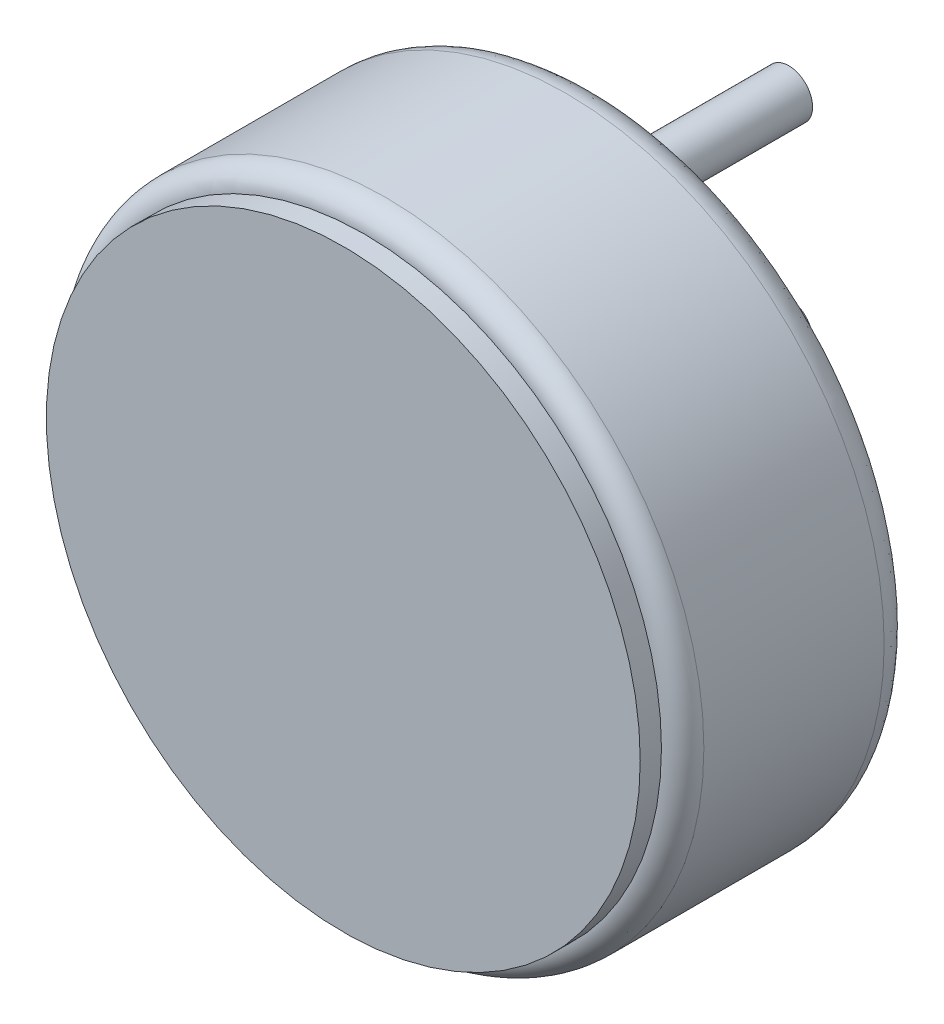
ISO-10303-21;
HEADER;
FILE_DESCRIPTION(('STEP AP214'),'2;1');
FILE_NAME('part.step','',(''),(''),'','','');
FILE_SCHEMA(('AUTOMOTIVE_DESIGN { 1 0 10303 214 1 1 1 1 }'));
ENDSEC;
DATA;
#1=APPLICATION_CONTEXT('core data for automotive mechanical design processes');
#2=APPLICATION_PROTOCOL_DEFINITION('international standard','automotive_design',2000,#1);
#3=PRODUCT_CONTEXT('',#1,'mechanical');
#4=PRODUCT('Part','Part','',(#3));
#5=PRODUCT_RELATED_PRODUCT_CATEGORY('part','',(#4));
#6=PRODUCT_DEFINITION_FORMATION('','',#4);
#7=PRODUCT_DEFINITION_CONTEXT('part definition',#1,'design');
#8=PRODUCT_DEFINITION('design','',#6,#7);
#9=PRODUCT_DEFINITION_SHAPE('','',#8);
#10=(LENGTH_UNIT() NAMED_UNIT(*) SI_UNIT(.MILLI.,.METRE.));
#11=(NAMED_UNIT(*) PLANE_ANGLE_UNIT() SI_UNIT($,.RADIAN.));
#12=(NAMED_UNIT(*) SI_UNIT($,.STERADIAN.) SOLID_ANGLE_UNIT());
#13=UNCERTAINTY_MEASURE_WITH_UNIT(LENGTH_MEASURE(1.E-05),#10,'distance_accuracy_value','');
#14=(GEOMETRIC_REPRESENTATION_CONTEXT(3) GLOBAL_UNCERTAINTY_ASSIGNED_CONTEXT((#13)) GLOBAL_UNIT_ASSIGNED_CONTEXT((#10,
#11,#12)) REPRESENTATION_CONTEXT('',''));
#15=CARTESIAN_POINT('',(0.,0.,0.));
#16=DIRECTION('',(0.,0.,1.));
#17=DIRECTION('',(1.,0.,0.));
#18=AXIS2_PLACEMENT_3D('',#15,#16,#17);
#19=CARTESIAN_POINT('',(0.,2.39999999999999,-0.8));
#20=CARTESIAN_POINT('',(-4.79999999999998,2.39999999999999,-0.8));
#21=CARTESIAN_POINT('',(-4.79999999999998,-2.39999999999999,-0.8));
#22=CARTESIAN_POINT('',(0.,-2.39999999999999,-0.8));
#23=CARTESIAN_POINT('',(4.79999999999998,-2.39999999999999,-0.8));
#24=CARTESIAN_POINT('',(4.79999999999998,2.39999999999999,-0.8));
#25=CARTESIAN_POINT('',(0.,2.39999999999999,-0.8));
#26=CARTESIAN_POINT('',(0.,2.39999999999999,-0.976682190684143));
#27=CARTESIAN_POINT('',(-4.79999999999998,2.39999999999999,-0.976682190684143));
#28=CARTESIAN_POINT('',(-4.79999999999998,-2.39999999999999,-0.976682190684143));
#29=CARTESIAN_POINT('',(0.,-2.39999999999999,-0.976682190684143));
#30=CARTESIAN_POINT('',(4.79999999999998,-2.39999999999999,-0.976682190684143));
#31=CARTESIAN_POINT('',(4.79999999999998,2.39999999999999,-0.976682190684143));
#32=CARTESIAN_POINT('',(0.,2.39999999999999,-0.976682190684143));
#33=CARTESIAN_POINT('',(0.,2.52521244331984,-1.10000000000001));
#34=CARTESIAN_POINT('',(-5.05042488663967,2.52521244331984,-1.10000000000001));
#35=CARTESIAN_POINT('',(-5.05042488663967,-2.52521244331984,-1.10000000000001));
#36=CARTESIAN_POINT('',(0.,-2.52521244331984,-1.10000000000001));
#37=CARTESIAN_POINT('',(5.05042488663967,-2.52521244331984,-1.10000000000001));
#38=CARTESIAN_POINT('',(5.05042488663967,2.52521244331984,-1.10000000000001));
#39=CARTESIAN_POINT('',(0.,2.52521244331984,-1.10000000000001));
#40=CARTESIAN_POINT('',(0.,2.7,-1.10000000000001));
#41=CARTESIAN_POINT('',(-5.40000000000001,2.7,-1.10000000000001));
#42=CARTESIAN_POINT('',(-5.40000000000001,-2.7,-1.10000000000001));
#43=CARTESIAN_POINT('',(0.,-2.7,-1.10000000000001));
#44=CARTESIAN_POINT('',(5.40000000000001,-2.7,-1.10000000000001));
#45=CARTESIAN_POINT('',(5.40000000000001,2.7,-1.10000000000001));
#46=CARTESIAN_POINT('',(0.,2.7,-1.10000000000001));
#47=CARTESIAN_POINT('',(0.,2.87478755668017,-1.10000000000001));
#48=CARTESIAN_POINT('',(-5.74957511336034,2.87478755668017,-1.10000000000001));
#49=CARTESIAN_POINT('',(-5.74957511336034,-2.87478755668017,-1.10000000000001));
#50=CARTESIAN_POINT('',(0.,-2.87478755668017,-1.10000000000001));
#51=CARTESIAN_POINT('',(5.74957511336034,-2.87478755668017,-1.10000000000001));
#52=CARTESIAN_POINT('',(5.74957511336034,2.87478755668017,-1.10000000000001));
#53=CARTESIAN_POINT('',(0.,2.87478755668017,-1.10000000000001));
#54=CARTESIAN_POINT('',(0.,3.00000000000001,-0.97668219068414));
#55=CARTESIAN_POINT('',(-6.00000000000002,3.00000000000001,-0.97668219068414));
#56=CARTESIAN_POINT('',(-6.00000000000002,-3.00000000000001,-0.97668219068414));
#57=CARTESIAN_POINT('',(0.,-3.00000000000001,-0.97668219068414));
#58=CARTESIAN_POINT('',(6.00000000000002,-3.00000000000001,-0.97668219068414));
#59=CARTESIAN_POINT('',(6.00000000000002,3.00000000000001,-0.97668219068414));
#60=CARTESIAN_POINT('',(0.,3.00000000000001,-0.97668219068414));
#61=CARTESIAN_POINT('',(0.,3.00000000000001,-0.8));
#62=CARTESIAN_POINT('',(-6.00000000000002,3.00000000000001,-0.8));
#63=CARTESIAN_POINT('',(-6.00000000000002,-3.00000000000001,-0.8));
#64=CARTESIAN_POINT('',(0.,-3.00000000000001,-0.8));
#65=CARTESIAN_POINT('',(6.00000000000002,-3.00000000000001,-0.8));
#66=CARTESIAN_POINT('',(6.00000000000002,3.00000000000001,-0.8));
#67=CARTESIAN_POINT('',(0.,3.00000000000001,-0.8));
#68=(BOUNDED_SURFACE() B_SPLINE_SURFACE(3,3,((#19,#20,#21,#22,#23,#24,#25),(#26,#27,#28,#29,#30,
#31,#32),(#33,#34,#35,#36,#37,#38,#39),(#40,#41,#42,#43,#44,#45,#46),(#47,#48,#49,#50,#51,#52,
#53),(#54,#55,#56,#57,#58,#59,#60),(#61,#62,#63,#64,#65,#66,#67)),.UNSPECIFIED.,.F.,.T.,
.F.) B_SPLINE_SURFACE_WITH_KNOTS((4,3,4),(4,3,4),(0.0212660887288256,0.5,0.978733911271166),(0.,
0.5,1.),
.UNSPECIFIED.) GEOMETRIC_REPRESENTATION_ITEM() RATIONAL_B_SPLINE_SURFACE(((0.974307502872988,
0.324769167624329,0.324769167624329,0.974307502872988,0.324769167624329,0.324769167624329,
0.974307502872988),(0.790078503890234,0.263359501296745,0.263359501296745,0.790078503890234,
0.263359501296745,0.263359501296745,0.790078503890234),(0.798642669599238,0.266214223199746,
0.266214223199746,0.798642669599238,0.266214223199746,0.266214223199746,0.798642669599238),(1.,
0.333333333333333,0.333333333333333,1.,0.333333333333333,0.333333333333333,1.),
(0.798642669599241,0.266214223199747,0.266214223199747,0.798642669599241,0.266214223199747,
0.266214223199747,0.798642669599241),(0.790078503890234,0.263359501296745,0.263359501296745,
0.790078503890234,0.263359501296745,0.263359501296745,0.790078503890234),(0.974307502872978,
0.324769167624326,0.324769167624326,0.974307502872978,0.324769167624326,0.324769167624326,0.974307502872978))) REPRESENTATION_ITEM('') SURFACE());
#69=CARTESIAN_POINT('',(0.,0.,-0.8));
#70=DIRECTION('',(0.,0.,-1.));
#71=DIRECTION('',(1.,0.,0.));
#72=AXIS2_PLACEMENT_3D('',#69,#70,#71);
#73=CIRCLE('',#72,2.39999999999999);
#74=CARTESIAN_POINT('',(0.,2.39999999999999,-0.8));
#75=VERTEX_POINT('',#74);
#76=EDGE_CURVE('E10',#75,#75,#73,.T.);
#77=CARTESIAN_POINT('',(0.,0.,-0.8));
#78=DIRECTION('',(0.,0.,1.));
#79=DIRECTION('',(0.,1.,0.));
#80=AXIS2_PLACEMENT_3D('',#77,#78,#79);
#81=CIRCLE('',#80,3.00000000000001);
#82=CARTESIAN_POINT('',(0.,3.00000000000001,-0.8));
#83=VERTEX_POINT('',#82);
#84=EDGE_CURVE('E26',#83,#83,#81,.T.);
#85=CARTESIAN_POINT('',(0.,2.39999999999999,-0.8));
#86=CARTESIAN_POINT('',(0.,2.39999999537428,-0.802248524345517));
#87=CARTESIAN_POINT('',(0.,2.40002527912279,-0.804497048930105));
#88=CARTESIAN_POINT('',(0.,2.40012682948026,-0.809012486777327));
#89=CARTESIAN_POINT('',(0.,2.40020353699144,-0.811279390131672));
#90=CARTESIAN_POINT('',(0.,2.40040921034804,-0.815830049550972));
#91=CARTESIAN_POINT('',(0.,2.40053861295298,-0.818113785883139));
#92=CARTESIAN_POINT('',(0.,2.40085089468133,-0.822696492031536));
#93=CARTESIAN_POINT('',(0.,2.40103420535382,-0.8249954324472));
#94=CARTESIAN_POINT('',(0.,2.40145546704193,-0.829606845405866));
#95=CARTESIAN_POINT('',(0.,2.40169384338838,-0.831919279100699));
#96=CARTESIAN_POINT('',(0.,2.40222633763611,-0.836555896950443));
#97=CARTESIAN_POINT('',(0.,2.40252087361232,-0.838880033097727));
#98=CARTESIAN_POINT('',(0.,2.40316672048629,-0.84353819608264));
#99=CARTESIAN_POINT('',(0.,2.40351844116687,-0.845872166110669));
#100=CARTESIAN_POINT('',(0.,2.40427961695318,-0.850548061678776));
#101=CARTESIAN_POINT('',(0.,2.40468947251464,-0.852889922035671));
#102=CARTESIAN_POINT('',(0.,2.40556779798212,-0.85757959083924));
#103=CARTESIAN_POINT('',(0.,2.40603665799158,-0.859927326229259));
#104=CARTESIAN_POINT('',(0.,2.4070337870254,-0.864626669078881));
#105=CARTESIAN_POINT('',(0.,2.40756243479207,-0.866978196180446));
#106=CARTESIAN_POINT('',(0.,2.40867984327279,-0.871682981961354));
#107=CARTESIAN_POINT('',(0.,2.40926897038304,-0.874036153624924));
#108=CARTESIAN_POINT('',(0.,2.41050794545649,-0.878742028169759));
#109=CARTESIAN_POINT('',(0.,2.41115814651607,-0.881094638091604));
#110=CARTESIAN_POINT('',(0.,2.41251977632833,-0.88579713399666));
#111=CARTESIAN_POINT('',(0.,2.41323154396272,-0.888146921859499));
#112=CARTESIAN_POINT('',(0.,2.41471670795497,-0.89284146922192));
#113=CARTESIAN_POINT('',(0.,2.41549042811144,-0.895186126288885));
#114=CARTESIAN_POINT('',(0.,2.41709978796353,-0.899868064332924));
#115=CARTESIAN_POINT('',(0.,2.41793573556019,-0.902205239476503));
#116=CARTESIAN_POINT('',(0.,2.41966972687206,-0.906869829027327));
#117=CARTESIAN_POINT('',(0.,2.42056806183751,-0.909197135170108));
#118=CARTESIAN_POINT('',(0.,2.42242688663436,-0.913839571923995));
#119=CARTESIAN_POINT('',(0.,2.42338765038032,-0.916154592863241));
#120=CARTESIAN_POINT('',(0.,2.42537127052421,-0.920770021393448));
#121=CARTESIAN_POINT('',(0.,2.42639438289113,-0.923070318976784));
#122=CARTESIAN_POINT('',(0.,2.42850251447644,-0.927653847405092));
#123=CARTESIAN_POINT('',(0.,2.42958777118961,-0.929936969020049));
#124=CARTESIAN_POINT('',(0.,2.43181987999413,-0.934483684275078));
#125=CARTESIAN_POINT('',(0.,2.43296695066433,-0.936747170610896));
#126=CARTESIAN_POINT('',(0.,2.43532224872052,-0.941252154185934));
#127=CARTESIAN_POINT('',(0.,2.43653067541965,-0.943493547222024));
#128=CARTESIAN_POINT('',(0.,2.4390081187625,-0.947951891337491));
#129=CARTESIAN_POINT('',(0.,2.44027731520013,-0.95016874250934));
#130=CARTESIAN_POINT('',(0.,2.44287560283889,-0.954575566578184));
#131=CARTESIAN_POINT('',(0.,2.44420485416096,-0.956765445068303));
#132=CARTESIAN_POINT('',(0.,2.44692242831212,-0.961115912356821));
#133=CARTESIAN_POINT('',(0.,2.44831089153789,-0.963276413455719));
#134=CARTESIAN_POINT('',(0.,2.45114593914593,-0.967565747827592));
#135=CARTESIAN_POINT('',(0.,2.45259264425349,-0.969694501307674));
#136=CARTESIAN_POINT('',(0.,2.45554309981455,-0.973918003935484));
#137=CARTESIAN_POINT('',(0.,2.45704695147971,-0.976012682379358));
#138=CARTESIAN_POINT('',(0.,2.46011050117144,-0.980165748305686));
#139=CARTESIAN_POINT('',(0.,2.46167028115851,-0.982224075329593));
#140=CARTESIAN_POINT('',(0.,2.46484436826723,-0.986302209758947));
#141=CARTESIAN_POINT('',(0.,2.4664587384642,-0.98832196807198));
#142=CARTESIAN_POINT('',(0.,2.4697405700882,-0.992320802275409));
#143=CARTESIAN_POINT('',(0.,2.47140807617255,-0.994299841515817));
#144=CARTESIAN_POINT('',(0.,2.47479463116794,-0.998215148232091));
#145=CARTESIAN_POINT('',(0.,2.47651370688351,-1.00015139252336));
#146=CARTESIAN_POINT('',(0.,2.4800017450072,-1.00397910074405));
#147=CARTESIAN_POINT('',(0.,2.48177071702612,-1.00587055591554));
#148=CARTESIAN_POINT('',(0.,2.4853567892188,-1.00960676494615));
#149=CARTESIAN_POINT('',(0.,2.48717388255742,-1.01145152536576));
#150=CARTESIAN_POINT('',(0.,2.49085434229836,-1.01509251806138));
#151=CARTESIAN_POINT('',(0.,2.49271768625022,-1.01688877303127));
#152=CARTESIAN_POINT('',(0.,2.49648870190555,-1.02043102811245));
#153=CARTESIAN_POINT('',(0.,2.49839633644992,-1.02217706778273));
#154=CARTESIAN_POINT('',(0.,2.50225390452663,-1.02561727114608));
#155=CARTESIAN_POINT('',(0.,2.50420378716664,-1.027311491906));
#156=CARTESIAN_POINT('',(0.,2.50814374637647,-1.0306465468535));
#157=CARTESIAN_POINT('',(0.,2.5101337593568,-1.03228745616475));
#158=CARTESIAN_POINT('',(0.,2.51415180538683,-1.03551449248629));
#159=CARTESIAN_POINT('',(0.,2.51617976323812,-1.03710071312834));
#160=CARTESIAN_POINT('',(0.,2.52027146411943,-1.04021709498321));
#161=CARTESIAN_POINT('',(0.,2.52233512147365,-1.04174736868645));
#162=CARTESIAN_POINT('',(0.,2.5264959334347,-1.04475070124111));
#163=CARTESIAN_POINT('',(0.,2.528592993054,-1.04622389168956));
#164=CARTESIAN_POINT('',(0.,2.53281827674251,-1.04911202648132));
#165=CARTESIAN_POINT('',(0.,2.53494639770299,-1.05052712167259));
#166=CARTESIAN_POINT('',(0.,2.5392314346586,-1.0532981606808));
#167=CARTESIAN_POINT('',(0.,2.54138824062978,-1.05465427463738));
#168=CARTESIAN_POINT('',(0.,2.54572824988936,-1.05730657305616));
#169=CARTESIAN_POINT('',(0.,2.54791133745074,-1.05860294688791));
#170=CARTESIAN_POINT('',(0.,2.55230149216963,-1.06113511460648));
#171=CARTESIAN_POINT('',(0.,2.55450843910637,-1.06237111693032));
#172=CARTESIAN_POINT('',(0.,2.55894388308146,-1.06478201873848));
#173=CARTESIAN_POINT('',(0.,2.56117225660289,-1.06595714546703));
#174=CARTESIAN_POINT('',(0.,2.56564812058703,-1.06824590001462));
#175=CARTESIAN_POINT('',(0.,2.56789548541418,-1.06935977353074));
#176=CARTESIAN_POINT('',(0.,2.57240690311669,-1.07152575108042));
#177=CARTESIAN_POINT('',(0.,2.57467082938735,-1.07257811881983));
#178=CARTESIAN_POINT('',(0.,2.57921295306136,-1.07462093784194));
#179=CARTESIAN_POINT('',(0.,2.58149102400486,-1.07561167031065));
#180=CARTESIAN_POINT('',(0.,2.58605903952902,-1.07753119297801));
#181=CARTESIAN_POINT('',(0.,2.58834885886645,-1.0784602812354));
#182=CARTESIAN_POINT('',(0.,2.59293800023669,-1.08025660788339));
#183=CARTESIAN_POINT('',(0.,2.59523719926629,-1.08112416052542));
#184=CARTESIAN_POINT('',(0.,2.59984276242135,-1.08279762314943));
#185=CARTESIAN_POINT('',(0.,2.6021490067532,-1.08360386282958));
#186=CARTESIAN_POINT('',(0.,2.6067663626668,-1.0851550176976));
#187=CARTESIAN_POINT('',(0.,2.60907735857567,-1.08590027722558));
#188=CARTESIAN_POINT('',(0.,2.6137019655574,-1.0873298966881));
#189=CARTESIAN_POINT('',(0.,2.61601546592683,-1.08801461474825));
#190=CARTESIAN_POINT('',(0.,2.62064288108322,-1.08932367833095));
#191=CARTESIAN_POINT('',(0.,2.62295669091928,-1.08994839486388));
#192=CARTESIAN_POINT('',(0.,2.62758258073606,-1.09113807973073));
#193=CARTESIAN_POINT('',(0.,2.62989456223349,-1.09170343102226));
#194=CARTESIAN_POINT('',(0.,2.63451471224953,-1.09277510189794));
#195=CARTESIAN_POINT('',(0.,2.63682278939784,-1.09328181541997));
#196=CARTESIAN_POINT('',(0.,2.64143311295041,-1.09423701406039));
#197=CARTESIAN_POINT('',(0.,2.64373527567201,-1.09468590310789));
#198=CARTESIAN_POINT('',(0.,2.64833182170198,-1.09552633740689));
#199=CARTESIAN_POINT('',(0.,2.65062612951896,-1.09591829557471));
#200=CARTESIAN_POINT('',(0.,2.65520508943277,-1.09664582839315));
#201=CARTESIAN_POINT('',(0.,2.65748967466246,-1.09698182393517));
#202=CARTESIAN_POINT('',(0.,2.66204738825685,-1.09759846173599));
#203=CARTESIAN_POINT('',(0.,2.66432045874185,-1.09787953184761));
#204=CARTESIAN_POINT('',(0.,2.66885341920073,-1.09838741321732));
#205=CARTESIAN_POINT('',(0.,2.67111326057729,-1.09861465828062));
#206=CARTESIAN_POINT('',(0.,2.67561811857107,-1.09901604241335));
#207=CARTESIAN_POINT('',(0.,2.67786309610187,-1.09919062024187));
#208=CARTESIAN_POINT('',(0.,2.68233666297445,-1.09948787545857));
#209=CARTESIAN_POINT('',(0.,2.6845652229056,-1.09961099557709));
#210=CARTESIAN_POINT('',(0.,2.68900447312779,-1.09980658794501));
#211=CARTESIAN_POINT('',(0.,2.69121514378657,-1.09987950593419));
#212=CARTESIAN_POINT('',(0.,2.69561721616707,-1.09997598805538));
#213=CARTESIAN_POINT('',(0.,2.69780860808354,-1.10000000000001));
#214=CARTESIAN_POINT('',(0.,2.70219139191646,-1.10000000000001));
#215=CARTESIAN_POINT('',(0.,2.70438278383293,-1.09997598805538));
#216=CARTESIAN_POINT('',(0.,2.70878485621343,-1.0998795059342));
#217=CARTESIAN_POINT('',(0.,2.71099552687221,-1.09980658794501));
#218=CARTESIAN_POINT('',(0.,2.7154347770944,-1.09961099557708));
#219=CARTESIAN_POINT('',(0.,2.71766333702555,-1.09948787545857));
#220=CARTESIAN_POINT('',(0.,2.72213690389813,-1.09919062024187));
#221=CARTESIAN_POINT('',(0.,2.72438188142893,-1.09901604241335));
#222=CARTESIAN_POINT('',(0.,2.72888673942271,-1.09861465828062));
#223=CARTESIAN_POINT('',(0.,2.73114658079927,-1.09838741321732));
#224=CARTESIAN_POINT('',(0.,2.73567954125815,-1.09787953184761));
#225=CARTESIAN_POINT('',(0.,2.73795261174315,-1.097598461736));
#226=CARTESIAN_POINT('',(0.,2.74251032533754,-1.09698182393517));
#227=CARTESIAN_POINT('',(0.,2.74479491056723,-1.09664582839315));
#228=CARTESIAN_POINT('',(0.,2.74937387048105,-1.09591829557471));
#229=CARTESIAN_POINT('',(0.,2.75166817829802,-1.09552633740689));
#230=CARTESIAN_POINT('',(0.,2.75626472432799,-1.09468590310789));
#231=CARTESIAN_POINT('',(0.,2.75856688704959,-1.09423701406039));
#232=CARTESIAN_POINT('',(0.,2.76317721060216,-1.09328181541997));
#233=CARTESIAN_POINT('',(0.,2.76548528775047,-1.09277510189794));
#234=CARTESIAN_POINT('',(0.,2.77010543776651,-1.09170343102226));
#235=CARTESIAN_POINT('',(0.,2.77241741926394,-1.09113807973073));
#236=CARTESIAN_POINT('',(0.,2.77704330908072,-1.08994839486388));
#237=CARTESIAN_POINT('',(0.,2.77935711891678,-1.08932367833095));
#238=CARTESIAN_POINT('',(0.,2.78398453407317,-1.08801461474825));
#239=CARTESIAN_POINT('',(0.,2.7862980344426,-1.0873298966881));
#240=CARTESIAN_POINT('',(0.,2.79092264142433,-1.08590027722558));
#241=CARTESIAN_POINT('',(0.,2.7932336373332,-1.0851550176976));
#242=CARTESIAN_POINT('',(0.,2.7978509932468,-1.08360386282959));
#243=CARTESIAN_POINT('',(0.,2.80015723757866,-1.08279762314943));
#244=CARTESIAN_POINT('',(0.,2.80476280073371,-1.08112416052542));
#245=CARTESIAN_POINT('',(0.,2.80706199976331,-1.08025660788339));
#246=CARTESIAN_POINT('',(0.,2.81165114113355,-1.0784602812354));
#247=CARTESIAN_POINT('',(0.,2.81394096047098,-1.07753119297801));
#248=CARTESIAN_POINT('',(0.,2.81850897599514,-1.07561167031065));
#249=CARTESIAN_POINT('',(0.,2.82078704693864,-1.07462093784194));
#250=CARTESIAN_POINT('',(0.,2.82532917061265,-1.07257811881983));
#251=CARTESIAN_POINT('',(0.,2.82759309688331,-1.07152575108042));
#252=CARTESIAN_POINT('',(0.,2.83210451458582,-1.06935977353074));
#253=CARTESIAN_POINT('',(0.,2.83435187941297,-1.06824590001462));
#254=CARTESIAN_POINT('',(0.,2.83882774339711,-1.06595714546703));
#255=CARTESIAN_POINT('',(0.,2.84105611691854,-1.06478201873848));
#256=CARTESIAN_POINT('',(0.,2.84549156089363,-1.06237111693032));
#257=CARTESIAN_POINT('',(0.,2.84769850783037,-1.06113511460648));
#258=CARTESIAN_POINT('',(0.,2.85208866254926,-1.05860294688791));
#259=CARTESIAN_POINT('',(0.,2.85427175011064,-1.05730657305616));
#260=CARTESIAN_POINT('',(0.,2.85861175937022,-1.05465427463739));
#261=CARTESIAN_POINT('',(0.,2.8607685653414,-1.0532981606808));
#262=CARTESIAN_POINT('',(0.,2.86505360229701,-1.0505271216726));
#263=CARTESIAN_POINT('',(0.,2.86718172325748,-1.04911202648132));
#264=CARTESIAN_POINT('',(0.,2.871407006946,-1.04622389168956));
#265=CARTESIAN_POINT('',(0.,2.8735040665653,-1.04475070124112));
#266=CARTESIAN_POINT('',(0.,2.87766487852635,-1.04174736868645));
#267=CARTESIAN_POINT('',(0.,2.87972853588057,-1.04021709498321));
#268=CARTESIAN_POINT('',(0.,2.88382023676188,-1.03710071312834));
#269=CARTESIAN_POINT('',(0.,2.88584819461317,-1.0355144924863));
#270=CARTESIAN_POINT('',(0.,2.8898662406432,-1.03228745616475));
#271=CARTESIAN_POINT('',(0.,2.89185625362353,-1.0306465468535));
#272=CARTESIAN_POINT('',(0.,2.89579621283336,-1.027311491906));
#273=CARTESIAN_POINT('',(0.,2.89774609547336,-1.02561727114608));
#274=CARTESIAN_POINT('',(0.,2.90160366355008,-1.02217706778273));
#275=CARTESIAN_POINT('',(0.,2.90351129809445,-1.02043102811246));
#276=CARTESIAN_POINT('',(0.,2.90728231374978,-1.01688877303127));
#277=CARTESIAN_POINT('',(0.,2.90914565770164,-1.01509251806138));
#278=CARTESIAN_POINT('',(0.,2.91282611744258,-1.01145152536576));
#279=CARTESIAN_POINT('',(0.,2.9146432107812,-1.00960676494615));
#280=CARTESIAN_POINT('',(0.,2.91822928297388,-1.00587055591554));
#281=CARTESIAN_POINT('',(0.,2.9199982549928,-1.00397910074405));
#282=CARTESIAN_POINT('',(0.,2.92348629311649,-1.00015139252337));
#283=CARTESIAN_POINT('',(0.,2.92520536883206,-0.998215148232092));
#284=CARTESIAN_POINT('',(0.,2.92859192382745,-0.994299841515818));
#285=CARTESIAN_POINT('',(0.,2.9302594299118,-0.99232080227541));
#286=CARTESIAN_POINT('',(0.,2.9335412615358,-0.988321968071981));
#287=CARTESIAN_POINT('',(0.,2.93515563173277,-0.986302209758948));
#288=CARTESIAN_POINT('',(0.,2.93832971884149,-0.982224075329595));
#289=CARTESIAN_POINT('',(0.,2.93988949882856,-0.980165748305687));
#290=CARTESIAN_POINT('',(0.,2.94295304852029,-0.976012682379359));
#291=CARTESIAN_POINT('',(0.,2.94445690018545,-0.973918003935486));
#292=CARTESIAN_POINT('',(0.,2.94740735574651,-0.969694501307676));
#293=CARTESIAN_POINT('',(0.,2.94885406085407,-0.967565747827593));
#294=CARTESIAN_POINT('',(0.,2.95168910846211,-0.96327641345572));
#295=CARTESIAN_POINT('',(0.,2.95307757168788,-0.961115912356822));
#296=CARTESIAN_POINT('',(0.,2.95579514583904,-0.956765445068304));
#297=CARTESIAN_POINT('',(0.,2.95712439716111,-0.954575566578185));
#298=CARTESIAN_POINT('',(0.,2.95972268479987,-0.950168742509341));
#299=CARTESIAN_POINT('',(0.,2.9609918812375,-0.947951891337493));
#300=CARTESIAN_POINT('',(0.,2.96346932458035,-0.943493547222025));
#301=CARTESIAN_POINT('',(0.,2.96467775127948,-0.941252154185935));
#302=CARTESIAN_POINT('',(0.,2.96703304933567,-0.936747170610897));
#303=CARTESIAN_POINT('',(0.,2.96818012000587,-0.934483684275079));
#304=CARTESIAN_POINT('',(0.,2.97041222881039,-0.92993696902005));
#305=CARTESIAN_POINT('',(0.,2.97149748552356,-0.927653847405093));
#306=CARTESIAN_POINT('',(0.,2.97360561710887,-0.923070318976785));
#307=CARTESIAN_POINT('',(0.,2.97462872947579,-0.920770021393449));
#308=CARTESIAN_POINT('',(0.,2.97661234961968,-0.916154592863242));
#309=CARTESIAN_POINT('',(0.,2.97757311336564,-0.913839571923996));
#310=CARTESIAN_POINT('',(0.,2.97943193816249,-0.90919713517011));
#311=CARTESIAN_POINT('',(0.,2.98033027312794,-0.906869829027328));
#312=CARTESIAN_POINT('',(0.,2.98206426443981,-0.902205239476504));
#313=CARTESIAN_POINT('',(0.,2.98290021203646,-0.899868064332925));
#314=CARTESIAN_POINT('',(0.,2.98450957188856,-0.895186126288887));
#315=CARTESIAN_POINT('',(0.,2.98528329204503,-0.892841469221922));
#316=CARTESIAN_POINT('',(0.,2.98676845603728,-0.8881469218595));
#317=CARTESIAN_POINT('',(0.,2.98748022367167,-0.885797133996661));
#318=CARTESIAN_POINT('',(0.,2.98884185348393,-0.881094638091605));
#319=CARTESIAN_POINT('',(0.,2.98949205454351,-0.87874202816976));
#320=CARTESIAN_POINT('',(0.,2.99073102961696,-0.874036153624925));
#321=CARTESIAN_POINT('',(0.,2.99132015672721,-0.871682981961356));
#322=CARTESIAN_POINT('',(0.,2.99243756520793,-0.866978196180447));
#323=CARTESIAN_POINT('',(0.,2.9929662129746,-0.864626669078882));
#324=CARTESIAN_POINT('',(0.,2.99396334200842,-0.85992732622926));
#325=CARTESIAN_POINT('',(0.,2.99443220201788,-0.857579590839241));
#326=CARTESIAN_POINT('',(0.,2.99531052748536,-0.852889922035672));
#327=CARTESIAN_POINT('',(0.,2.99572038304682,-0.850548061678777));
#328=CARTESIAN_POINT('',(0.,2.99648155883313,-0.84587216611067));
#329=CARTESIAN_POINT('',(0.,2.99683327951371,-0.843538196082641));
#330=CARTESIAN_POINT('',(0.,2.99747912638768,-0.838880033097728));
#331=CARTESIAN_POINT('',(0.,2.99777366236389,-0.836555896950444));
#332=CARTESIAN_POINT('',(0.,2.99830615661162,-0.831919279100699));
#333=CARTESIAN_POINT('',(0.,2.99854453295807,-0.829606845405867));
#334=CARTESIAN_POINT('',(0.,2.99896579464618,-0.824995432447201));
#335=CARTESIAN_POINT('',(0.,2.99914910531867,-0.822696492031537));
#336=CARTESIAN_POINT('',(0.,2.99946138704702,-0.81811378588314));
#337=CARTESIAN_POINT('',(0.,2.99959078965196,-0.815830049550972));
#338=CARTESIAN_POINT('',(0.,2.99979646300856,-0.811279390131673));
#339=CARTESIAN_POINT('',(0.,2.99987317051974,-0.809012486777327));
#340=CARTESIAN_POINT('',(0.,2.99997472087721,-0.804497048930105));
#341=CARTESIAN_POINT('',(0.,3.00000000462572,-0.802248524345517));
#342=CARTESIAN_POINT('',(0.,3.00000000000001,-0.8));
#343=B_SPLINE_CURVE_WITH_KNOTS('',3,(#85,#86,#87,#88,#89,#90,#91,#92,#93,#94,#95,#96,#97,#98,
#99,#100,#101,#102,#103,#104,#105,#106,#107,#108,#109,#110,#111,#112,#113,#114,#115,#116,#117,
#118,#119,#120,#121,#122,#123,#124,#125,#126,#127,#128,#129,#130,#131,#132,#133,#134,#135,#136,
#137,#138,#139,#140,#141,#142,#143,#144,#145,#146,#147,#148,#149,#150,#151,#152,#153,#154,#155,
#156,#157,#158,#159,#160,#161,#162,#163,#164,#165,#166,#167,#168,#169,#170,#171,#172,#173,#174,
#175,#176,#177,#178,#179,#180,#181,#182,#183,#184,#185,#186,#187,#188,#189,#190,#191,#192,#193,
#194,#195,#196,#197,#198,#199,#200,#201,#202,#203,#204,#205,#206,#207,#208,#209,#210,#211,#212,
#213,#214,#215,#216,#217,#218,#219,#220,#221,#222,#223,#224,#225,#226,#227,#228,#229,#230,#231,
#232,#233,#234,#235,#236,#237,#238,#239,#240,#241,#242,#243,#244,#245,#246,#247,#248,#249,#250,
#251,#252,#253,#254,#255,#256,#257,#258,#259,#260,#261,#262,#263,#264,#265,#266,#267,#268,#269,
#270,#271,#272,#273,#274,#275,#276,#277,#278,#279,#280,#281,#282,#283,#284,#285,#286,#287,#288,
#289,#290,#291,#292,#293,#294,#295,#296,#297,#298,#299,#300,#301,#302,#303,#304,#305,#306,#307,
#308,#309,#310,#311,#312,#313,#314,#315,#316,#317,#318,#319,#320,#321,#322,#323,#324,#325,#326,
#327,#328,#329,#330,#331,#332,#333,#334,#335,#336,#337,#338,#339,#340,#341,#342),.UNSPECIFIED.,
.F.,.F.,(4,2,2,2,2,2,2,2,2,2,2,2,2,2,2,2,2,2,2,2,2,2,2,2,2,2,2,2,2,2,2,2,2,2,2,2,2,2,2,2,2,2,2,
2,2,2,2,2,2,2,2,2,2,2,2,2,2,2,2,2,2,2,2,2,2,2,2,2,2,2,2,2,2,2,2,2,2,2,2,2,2,2,2,2,2,2,2,2,2,2,2,
2,2,2,2,2,2,2,2,2,2,2,2,2,2,2,2,2,2,2,2,2,2,2,2,2,2,2,2,2,2,2,2,2,2,2,2,2,4),(0.,
0.00674543188116748,0.0135494509351596,0.0204110512286289,0.0273291495072586,0.034302584538546,
0.0413301166635844,0.0484104275702695,0.05554212029964,0.06272371949619,0.0699536719119792,
0.0772303471731977,0.0845520388165392,0.0919169656012802,0.0993232731013926,0.106769035580315,
0.114252258149193,0.121770879207525,0.129322773163136,0.136905753426428,0.144517575671727,
0.152155941356548,0.159818501487471,0.167502860619356,0.175206581072628,0.182927187351533,
0.190662170744475,0.198408994085972,0.206165096658289,0.213927899209538,0.221694809063999,
0.229463225299507,0.237230543966181,0.244994163320345,0.252751489047382,0.260499939447334,
0.268236950557424,0.275959981186275,0.283666517835397,0.291354079484557,0.299020222218892,
0.306662543677046,0.314278687301193,0.321866346371546,0.329423267809814,0.336947255737978,
0.344436174780808,0.351887953102571,0.359300585170473,0.366672134239404,0.374000734554656,
0.381284593271194,0.388521992090021,0.395711288613989,0.40285091742711,0.409939390903036,
0.416975299749839,0.423957313299557,0.43088417955214,0.437754724984527,0.444567854136369,
0.451322548984802,0.458017868121118,0.464652945742761,0.471226990474316,0.477801035205872,
0.484436112827515,0.491131431963831,0.497886126812263,0.504699255964106,0.511569801396491,
0.518496667649076,0.525478681198793,0.532514590045597,0.539603063521522,0.546742692334643,
0.553931988858612,0.561169387677438,0.568453246393976,0.575781846709229,0.583153395778159,
0.59056602784606,0.598017806167825,0.605506725210654,0.613030713138818,0.620587634577086,
0.628175293647439,0.635791437271585,0.643433758729738,0.651099901464074,0.658787463113233,
0.666493999762356,0.674217030391208,0.681954041501298,0.689702491901249,0.697459817628286,
0.70522343698245,0.712990755649124,0.720759171884632,0.728526081739093,0.736288884290343,
0.744044986862659,0.751791810204156,0.759526793597098,0.767247399876003,0.774951120329276,
0.782635479461161,0.790298039592084,0.797936405276904,0.805548227522203,0.813131207785495,
0.820683101741106,0.828201722799438,0.835684945368316,0.843130707847238,0.850537015347351,
0.857901942132092,0.865223633775434,0.872500309036652,0.879730261452441,0.886911860648991,
0.894043553378362,0.901123864285047,0.908151396410085,0.915124831441373,0.922042929720003,
0.928904530013472,0.935708549067464,0.942453980948632),.UNSPECIFIED.);
#344=EDGE_CURVE('',#75,#83,#343,.T.);
#345=ORIENTED_EDGE('',*,*,#76,.F.);
#346=ORIENTED_EDGE('',*,*,#84,.F.);
#347=ORIENTED_EDGE('',*,*,#344,.T.);
#348=ORIENTED_EDGE('',*,*,#344,.F.);
#349=EDGE_LOOP('',(#345,#347,#346,#348));
#350=FACE_BOUND('',#349,.T.);
#351=ADVANCED_FACE('F16',(#350),#68,.F.);
#352=CARTESIAN_POINT('',(2.498500117595,-2.496,-0.8));
#353=DIRECTION('',(0.,0.,1.));
#354=DIRECTION('',(0.,1.,0.));
#355=AXIS2_PLACEMENT_3D('',#352,#353,#354);
#356=PLANE('',#355);
#357=DIRECTION('',(-1.,0.,0.));
#358=VECTOR('',#357,1.);
#359=CARTESIAN_POINT('',(0.,0.275,-0.8));
#360=LINE('',#359,#358);
#361=CARTESIAN_POINT('',(1.774076562169,0.275,-0.8));
#362=VERTEX_POINT('',#361);
#363=CARTESIAN_POINT('',(0.9017361363204,0.275,-0.8));
#364=VERTEX_POINT('',#363);
#365=EDGE_CURVE('E170',#362,#364,#360,.T.);
#366=ORIENTED_EDGE('',*,*,#365,.F.);
#367=DIRECTION('',(0.,1.,0.));
#368=VECTOR('',#367,1.);
#369=CARTESIAN_POINT('',(1.774076562169,0.,-0.8));
#370=LINE('',#369,#368);
#371=CARTESIAN_POINT('',(1.774076562169,-0.35,-0.8));
#372=VERTEX_POINT('',#371);
#373=EDGE_CURVE('E35',#372,#362,#370,.T.);
#374=ORIENTED_EDGE('',*,*,#373,.F.);
#375=DIRECTION('',(-1.,0.,0.));
#376=VECTOR('',#375,1.);
#377=CARTESIAN_POINT('',(0.,-0.35,-0.8));
#378=LINE('',#377,#376);
#379=CARTESIAN_POINT('',(1.90173613632,-0.35,-0.8));
#380=VERTEX_POINT('',#379);
#381=EDGE_CURVE('E177',#380,#372,#378,.T.);
#382=ORIENTED_EDGE('',*,*,#381,.F.);
#383=DIRECTION('',(0.,-1.,0.));
#384=VECTOR('',#383,1.);
#385=CARTESIAN_POINT('',(1.90173613632,0.,-0.8));
#386=LINE('',#385,#384);
#387=CARTESIAN_POINT('',(1.90173613632,0.4,-0.8));
#388=VERTEX_POINT('',#387);
#389=EDGE_CURVE('E182',#388,#380,#386,.T.);
#390=ORIENTED_EDGE('',*,*,#389,.F.);
#391=DIRECTION('',(1.,0.,0.));
#392=VECTOR('',#391,1.);
#393=CARTESIAN_POINT('',(0.,0.4,-0.8));
#394=LINE('',#393,#392);
#395=CARTESIAN_POINT('',(0.9017361363204,0.4,-0.8));
#396=VERTEX_POINT('',#395);
#397=EDGE_CURVE('E89',#396,#388,#394,.T.);
#398=ORIENTED_EDGE('',*,*,#397,.F.);
#399=DIRECTION('',(0.,1.,0.));
#400=VECTOR('',#399,1.);
#401=CARTESIAN_POINT('',(0.9017361363204,0.,-0.8));
#402=LINE('',#401,#400);
#403=EDGE_CURVE('E190',#364,#396,#402,.T.);
#404=ORIENTED_EDGE('',*,*,#403,.F.);
#405=EDGE_LOOP('',(#366,#374,#382,#390,#398,#404));
#406=FACE_BOUND('',#405,.T.);
#407=CARTESIAN_POINT('',(0.,-1.5,-0.8));
#408=DIRECTION('',(0.,0.,-1.));
#409=DIRECTION('',(-1.,0.,0.));
#410=AXIS2_PLACEMENT_3D('',#407,#408,#409);
#411=CIRCLE('',#410,0.3);
#412=CARTESIAN_POINT('',(-0.3,-1.5,-0.8));
#413=VERTEX_POINT('',#412);
#414=EDGE_CURVE('E91',#413,#413,#411,.T.);
#415=ORIENTED_EDGE('',*,*,#414,.F.);
#416=EDGE_LOOP('',(#415));
#417=FACE_BOUND('',#416,.T.);
#418=CARTESIAN_POINT('',(0.,1.5,-0.8));
#419=DIRECTION('',(0.,0.,-1.));
#420=DIRECTION('',(-1.,0.,0.));
#421=AXIS2_PLACEMENT_3D('',#418,#419,#420);
#422=CIRCLE('',#421,0.3);
#423=CARTESIAN_POINT('',(-0.3,1.5,-0.8));
#424=VERTEX_POINT('',#423);
#425=EDGE_CURVE('E161',#424,#424,#422,.T.);
#426=ORIENTED_EDGE('',*,*,#425,.F.);
#427=EDGE_LOOP('',(#426));
#428=FACE_BOUND('',#427,.T.);
#429=CARTESIAN_POINT('',(-1.,0.95,-0.8));
#430=DIRECTION('',(0.,0.,-1.));
#431=DIRECTION('',(-1.,0.,0.));
#432=AXIS2_PLACEMENT_3D('',#429,#430,#431);
#433=CIRCLE('',#432,0.45);
#434=CARTESIAN_POINT('',(-1.45,0.95,-0.8));
#435=VERTEX_POINT('',#434);
#436=EDGE_CURVE('E157',#435,#435,#433,.T.);
#437=ORIENTED_EDGE('',*,*,#436,.F.);
#438=EDGE_LOOP('',(#437));
#439=FACE_BOUND('',#438,.T.);
#440=CARTESIAN_POINT('',(-1.,-0.95,-0.8));
#441=DIRECTION('',(0.,0.,-1.));
#442=DIRECTION('',(-1.,0.,0.));
#443=AXIS2_PLACEMENT_3D('',#440,#441,#442);
#444=CIRCLE('',#443,0.45);
#445=CARTESIAN_POINT('',(-1.45,-0.95,-0.8));
#446=VERTEX_POINT('',#445);
#447=EDGE_CURVE('E155',#446,#446,#444,.T.);
#448=ORIENTED_EDGE('',*,*,#447,.F.);
#449=EDGE_LOOP('',(#448));
#450=FACE_BOUND('',#449,.T.);
#451=ORIENTED_EDGE('',*,*,#76,.T.);
#452=EDGE_LOOP('',(#451));
#453=FACE_BOUND('',#452,.T.);
#454=ADVANCED_FACE('F199',(#406,#417,#428,#439,#450,#453),#356,.F.);
#455=CARTESIAN_POINT('',(0.,0.,-0.8));
#456=DIRECTION('',(0.,0.,1.));
#457=DIRECTION('',(1.,0.,0.));
#458=AXIS2_PLACEMENT_3D('',#455,#456,#457);
#459=CYLINDRICAL_SURFACE('',#458,3.);
#460=ORIENTED_EDGE('',*,*,#84,.T.);
#461=EDGE_LOOP('',(#460));
#462=FACE_BOUND('',#461,.T.);
#463=CARTESIAN_POINT('',(0.,0.,0.9));
#464=DIRECTION('',(0.,0.,1.));
#465=DIRECTION('',(0.,1.,0.));
#466=AXIS2_PLACEMENT_3D('',#463,#464,#465);
#467=CIRCLE('',#466,3.);
#468=CARTESIAN_POINT('',(0.,3.,0.9));
#469=VERTEX_POINT('',#468);
#470=EDGE_CURVE('E158',#469,#469,#467,.T.);
#471=ORIENTED_EDGE('',*,*,#470,.F.);
#472=EDGE_LOOP('',(#471));
#473=FACE_BOUND('',#472,.T.);
#474=ADVANCED_FACE('F202',(#462,#473),#459,.T.);
#475=CARTESIAN_POINT('',(0.9017361363204,0.2630577389076,-0.8319422610924));
#476=DIRECTION('',(1.,0.,0.));
#477=DIRECTION('',(0.,1.,0.));
#478=AXIS2_PLACEMENT_3D('',#475,#476,#477);
#479=PLANE('',#478);
#480=DIRECTION('',(0.,1.,0.));
#481=VECTOR('',#480,1.);
#482=CARTESIAN_POINT('',(0.9017361363204,0.3375,-0.82));
#483=LINE('',#482,#481);
#484=CARTESIAN_POINT('',(0.9017361363204,0.275,-0.82));
#485=VERTEX_POINT('',#484);
#486=CARTESIAN_POINT('',(0.9017361363204,0.4,-0.82));
#487=VERTEX_POINT('',#486);
#488=EDGE_CURVE('E95',#485,#487,#483,.T.);
#489=ORIENTED_EDGE('',*,*,#488,.F.);
#490=DIRECTION('',(0.,0.,-1.));
#491=VECTOR('',#490,1.);
#492=CARTESIAN_POINT('',(0.9017361363204,0.275,-0.81));
#493=LINE('',#492,#491);
#494=EDGE_CURVE('E167',#364,#485,#493,.T.);
#495=ORIENTED_EDGE('',*,*,#494,.F.);
#496=ORIENTED_EDGE('',*,*,#403,.T.);
#497=DIRECTION('',(0.,0.,1.));
#498=VECTOR('',#497,1.);
#499=CARTESIAN_POINT('',(0.9017361363204,0.4,-0.81));
#500=LINE('',#499,#498);
#501=EDGE_CURVE('E171',#487,#396,#500,.T.);
#502=ORIENTED_EDGE('',*,*,#501,.F.);
#503=EDGE_LOOP('',(#489,#495,#496,#502));
#504=FACE_BOUND('',#503,.T.);
#505=ADVANCED_FACE('F224',(#504),#479,.F.);
#506=CARTESIAN_POINT('',(1.791523370686,0.275,-0.8319422610924));
#507=DIRECTION('',(0.,1.,0.));
#508=DIRECTION('',(-1.,0.,0.));
#509=AXIS2_PLACEMENT_3D('',#506,#507,#508);
#510=PLANE('',#509);
#511=DIRECTION('',(-1.,0.,0.));
#512=VECTOR('',#511,1.);
#513=CARTESIAN_POINT('',(1.3379063492447,0.275,-0.82));
#514=LINE('',#513,#512);
#515=CARTESIAN_POINT('',(1.774076562169,0.275,-0.82));
#516=VERTEX_POINT('',#515);
#517=EDGE_CURVE('E98',#516,#485,#514,.T.);
#518=ORIENTED_EDGE('',*,*,#517,.F.);
#519=DIRECTION('',(0.,0.,-1.));
#520=VECTOR('',#519,1.);
#521=CARTESIAN_POINT('',(1.774076562169,0.275,-0.81));
#522=LINE('',#521,#520);
#523=EDGE_CURVE('E175',#362,#516,#522,.T.);
#524=ORIENTED_EDGE('',*,*,#523,.F.);
#525=ORIENTED_EDGE('',*,*,#365,.T.);
#526=ORIENTED_EDGE('',*,*,#494,.T.);
#527=EDGE_LOOP('',(#518,#524,#525,#526));
#528=FACE_BOUND('',#527,.T.);
#529=ADVANCED_FACE('F220',(#528),#510,.F.);
#530=CARTESIAN_POINT('',(1.774076562169,-0.3625,-0.8319422610924));
#531=DIRECTION('',(1.,0.,0.));
#532=DIRECTION('',(0.,1.,0.));
#533=AXIS2_PLACEMENT_3D('',#530,#531,#532);
#534=PLANE('',#533);
#535=DIRECTION('',(0.,1.,0.));
#536=VECTOR('',#535,1.);
#537=CARTESIAN_POINT('',(1.774076562169,-0.0375,-0.82));
#538=LINE('',#537,#536);
#539=CARTESIAN_POINT('',(1.774076562169,-0.35,-0.82));
#540=VERTEX_POINT('',#539);
#541=EDGE_CURVE('E174',#540,#516,#538,.T.);
#542=ORIENTED_EDGE('',*,*,#541,.F.);
#543=DIRECTION('',(0.,0.,-1.));
#544=VECTOR('',#543,1.);
#545=CARTESIAN_POINT('',(1.774076562169,-0.35,-0.81));
#546=LINE('',#545,#544);
#547=EDGE_CURVE('E180',#372,#540,#546,.T.);
#548=ORIENTED_EDGE('',*,*,#547,.F.);
#549=ORIENTED_EDGE('',*,*,#373,.T.);
#550=ORIENTED_EDGE('',*,*,#523,.T.);
#551=EDGE_LOOP('',(#542,#548,#549,#550));
#552=FACE_BOUND('',#551,.T.);
#553=ADVANCED_FACE('F232',(#552),#534,.F.);
#554=CARTESIAN_POINT('',(1.913678397413,-0.35,-0.8319422610924));
#555=DIRECTION('',(0.,1.,0.));
#556=DIRECTION('',(-1.,0.,0.));
#557=AXIS2_PLACEMENT_3D('',#554,#555,#556);
#558=PLANE('',#557);
#559=DIRECTION('',(-1.,0.,0.));
#560=VECTOR('',#559,1.);
#561=CARTESIAN_POINT('',(1.837906349245,-0.35,-0.82));
#562=LINE('',#561,#560);
#563=CARTESIAN_POINT('',(1.90173613632,-0.35,-0.82));
#564=VERTEX_POINT('',#563);
#565=EDGE_CURVE('E69',#564,#540,#562,.T.);
#566=ORIENTED_EDGE('',*,*,#565,.F.);
#567=DIRECTION('',(0.,0.,-1.));
#568=VECTOR('',#567,1.);
#569=CARTESIAN_POINT('',(1.90173613632,-0.35,-0.81));
#570=LINE('',#569,#568);
#571=EDGE_CURVE('E79',#380,#564,#570,.T.);
#572=ORIENTED_EDGE('',*,*,#571,.F.);
#573=ORIENTED_EDGE('',*,*,#381,.T.);
#574=ORIENTED_EDGE('',*,*,#547,.T.);
#575=EDGE_LOOP('',(#566,#572,#573,#574));
#576=FACE_BOUND('',#575,.T.);
#577=ADVANCED_FACE('F238',(#576),#558,.F.);
#578=CARTESIAN_POINT('',(1.90173613632,0.415,-0.7880577389076));
#579=DIRECTION('',(1.,0.,0.));
#580=DIRECTION('',(0.,-1.,0.));
#581=AXIS2_PLACEMENT_3D('',#578,#579,#580);
#582=PLANE('',#581);
#583=DIRECTION('',(0.,-1.,0.));
#584=VECTOR('',#583,1.);
#585=CARTESIAN_POINT('',(1.90173613632,0.025,-0.82));
#586=LINE('',#585,#584);
#587=CARTESIAN_POINT('',(1.90173613632,0.4,-0.82));
#588=VERTEX_POINT('',#587);
#589=EDGE_CURVE('E75',#588,#564,#586,.T.);
#590=ORIENTED_EDGE('',*,*,#589,.F.);
#591=DIRECTION('',(0.,0.,-1.));
#592=VECTOR('',#591,1.);
#593=CARTESIAN_POINT('',(1.90173613632,0.4,-0.81));
#594=LINE('',#593,#592);
#595=EDGE_CURVE('E78',#388,#588,#594,.T.);
#596=ORIENTED_EDGE('',*,*,#595,.F.);
#597=ORIENTED_EDGE('',*,*,#389,.T.);
#598=ORIENTED_EDGE('',*,*,#571,.T.);
#599=EDGE_LOOP('',(#590,#596,#597,#598));
#600=FACE_BOUND('',#599,.T.);
#601=ADVANCED_FACE('F77',(#600),#582,.T.);
#602=CARTESIAN_POINT('',(0.8817361363204,0.4,-0.7880577389076));
#603=DIRECTION('',(0.,1.,0.));
#604=DIRECTION('',(1.,0.,0.));
#605=AXIS2_PLACEMENT_3D('',#602,#603,#604);
#606=PLANE('',#605);
#607=DIRECTION('',(1.,0.,0.));
#608=VECTOR('',#607,1.);
#609=CARTESIAN_POINT('',(1.4017361363202,0.4,-0.82));
#610=LINE('',#609,#608);
#611=EDGE_CURVE('E82',#487,#588,#610,.T.);
#612=ORIENTED_EDGE('',*,*,#611,.F.);
#613=ORIENTED_EDGE('',*,*,#501,.T.);
#614=ORIENTED_EDGE('',*,*,#397,.T.);
#615=ORIENTED_EDGE('',*,*,#595,.T.);
#616=EDGE_LOOP('',(#612,#613,#614,#615));
#617=FACE_BOUND('',#616,.T.);
#618=ADVANCED_FACE('F87',(#617),#606,.T.);
#619=CARTESIAN_POINT('',(0.,-1.5,-0.5));
#620=DIRECTION('',(0.,0.,-1.));
#621=DIRECTION('',(-1.,0.,0.));
#622=AXIS2_PLACEMENT_3D('',#619,#620,#621);
#623=CYLINDRICAL_SURFACE('',#622,0.3);
#624=CARTESIAN_POINT('',(0.,-1.5,-0.5));
#625=DIRECTION('',(0.,0.,-1.));
#626=DIRECTION('',(-1.,0.,0.));
#627=AXIS2_PLACEMENT_3D('',#624,#625,#626);
#628=CIRCLE('',#627,0.3);
#629=CARTESIAN_POINT('',(-0.3,-1.5,-0.5));
#630=VERTEX_POINT('',#629);
#631=EDGE_CURVE('E83',#630,#630,#628,.T.);
#632=ORIENTED_EDGE('',*,*,#631,.F.);
#633=EDGE_LOOP('',(#632));
#634=FACE_BOUND('',#633,.T.);
#635=ORIENTED_EDGE('',*,*,#414,.T.);
#636=EDGE_LOOP('',(#635));
#637=FACE_BOUND('',#636,.T.);
#638=ADVANCED_FACE('F245',(#634,#637),#623,.F.);
#639=CARTESIAN_POINT('',(0.,1.5,-0.5));
#640=DIRECTION('',(0.,0.,-1.));
#641=DIRECTION('',(-1.,0.,0.));
#642=AXIS2_PLACEMENT_3D('',#639,#640,#641);
#643=CYLINDRICAL_SURFACE('',#642,0.3);
#644=CARTESIAN_POINT('',(0.,1.5,-0.5));
#645=DIRECTION('',(0.,0.,-1.));
#646=DIRECTION('',(-1.,0.,0.));
#647=AXIS2_PLACEMENT_3D('',#644,#645,#646);
#648=CIRCLE('',#647,0.3);
#649=CARTESIAN_POINT('',(-0.3,1.5,-0.5));
#650=VERTEX_POINT('',#649);
#651=EDGE_CURVE('E103',#650,#650,#648,.T.);
#652=ORIENTED_EDGE('',*,*,#651,.F.);
#653=EDGE_LOOP('',(#652));
#654=FACE_BOUND('',#653,.T.);
#655=ORIENTED_EDGE('',*,*,#425,.T.);
#656=EDGE_LOOP('',(#655));
#657=FACE_BOUND('',#656,.T.);
#658=ADVANCED_FACE('F197',(#654,#657),#643,.F.);
#659=CARTESIAN_POINT('',(-1.,0.95,-0.8));
#660=DIRECTION('',(0.,0.,-1.));
#661=DIRECTION('',(-1.,0.,0.));
#662=AXIS2_PLACEMENT_3D('',#659,#660,#661);
#663=CYLINDRICAL_SURFACE('',#662,0.45);
#664=CARTESIAN_POINT('',(-1.,0.95,-0.9999999999996));
#665=DIRECTION('',(0.,0.,-1.));
#666=DIRECTION('',(-1.,0.,0.));
#667=AXIS2_PLACEMENT_3D('',#664,#665,#666);
#668=CIRCLE('',#667,0.45);
#669=CARTESIAN_POINT('',(-1.45,0.95,-0.9999999999996));
#670=VERTEX_POINT('',#669);
#671=EDGE_CURVE('E106',#670,#670,#668,.T.);
#672=ORIENTED_EDGE('',*,*,#671,.F.);
#673=EDGE_LOOP('',(#672));
#674=FACE_BOUND('',#673,.T.);
#675=ORIENTED_EDGE('',*,*,#436,.T.);
#676=EDGE_LOOP('',(#675));
#677=FACE_BOUND('',#676,.T.);
#678=ADVANCED_FACE('F151',(#674,#677),#663,.T.);
#679=CARTESIAN_POINT('',(-1.,-0.95,-0.8));
#680=DIRECTION('',(0.,0.,-1.));
#681=DIRECTION('',(-1.,0.,0.));
#682=AXIS2_PLACEMENT_3D('',#679,#680,#681);
#683=CYLINDRICAL_SURFACE('',#682,0.45);
#684=CARTESIAN_POINT('',(-1.,-0.95,-0.9999999999996));
#685=DIRECTION('',(0.,0.,-1.));
#686=DIRECTION('',(-1.,0.,0.));
#687=AXIS2_PLACEMENT_3D('',#684,#685,#686);
#688=CIRCLE('',#687,0.45);
#689=CARTESIAN_POINT('',(-1.45,-0.95,-0.9999999999996));
#690=VERTEX_POINT('',#689);
#691=EDGE_CURVE('E109',#690,#690,#688,.T.);
#692=ORIENTED_EDGE('',*,*,#691,.F.);
#693=EDGE_LOOP('',(#692));
#694=FACE_BOUND('',#693,.T.);
#695=ORIENTED_EDGE('',*,*,#447,.T.);
#696=EDGE_LOOP('',(#695));
#697=FACE_BOUND('',#696,.T.);
#698=ADVANCED_FACE('F148',(#694,#697),#683,.T.);
#699=CARTESIAN_POINT('',(0.,0.,0.9));
#700=DIRECTION('',(0.,0.,1.));
#701=DIRECTION('',(1.,0.,0.));
#702=AXIS2_PLACEMENT_3D('',#699,#700,#701);
#703=TOROIDAL_SURFACE('',#702,2.79999999999954,0.20000000000001);
#704=ORIENTED_EDGE('',*,*,#470,.T.);
#705=EDGE_LOOP('',(#704));
#706=FACE_BOUND('',#705,.T.);
#707=CARTESIAN_POINT('',(0.,0.,1.10000000000001));
#708=DIRECTION('',(0.,0.,1.));
#709=DIRECTION('',(-0.00432074460833285,0.999990665539449,0.));
#710=AXIS2_PLACEMENT_3D('',#707,#708,#709);
#711=CIRCLE('',#710,2.8);
#712=CARTESIAN_POINT('',(-0.012098084903332,2.79997386351046,1.10000000000001));
#713=VERTEX_POINT('',#712);
#714=EDGE_CURVE('E112',#713,#713,#711,.T.);
#715=ORIENTED_EDGE('',*,*,#714,.F.);
#716=EDGE_LOOP('',(#715));
#717=FACE_BOUND('',#716,.T.);
#718=ADVANCED_FACE('F18',(#706,#717),#703,.T.);
#719=CARTESIAN_POINT('',(0.8817361363204,0.415,-0.82));
#720=DIRECTION('',(0.,0.,1.));
#721=DIRECTION('',(0.,-1.,0.));
#722=AXIS2_PLACEMENT_3D('',#719,#720,#721);
#723=PLANE('',#722);
#724=ORIENTED_EDGE('',*,*,#565,.T.);
#725=ORIENTED_EDGE('',*,*,#541,.T.);
#726=ORIENTED_EDGE('',*,*,#517,.T.);
#727=ORIENTED_EDGE('',*,*,#488,.T.);
#728=ORIENTED_EDGE('',*,*,#611,.T.);
#729=ORIENTED_EDGE('',*,*,#589,.T.);
#730=EDGE_LOOP('',(#724,#725,#726,#727,#728,#729));
#731=FACE_BOUND('',#730,.T.);
#732=ADVANCED_FACE('F93',(#731),#723,.F.);
#733=CARTESIAN_POINT('',(0.312,-1.187999998029,-0.5));
#734=DIRECTION('',(0.,0.,1.));
#735=DIRECTION('',(-1.,0.,0.));
#736=AXIS2_PLACEMENT_3D('',#733,#734,#735);
#737=PLANE('',#736);
#738=ORIENTED_EDGE('',*,*,#631,.T.);
#739=EDGE_LOOP('',(#738));
#740=FACE_BOUND('',#739,.T.);
#741=ADVANCED_FACE('F257',(#740),#737,.F.);
#742=CARTESIAN_POINT('',(0.312,1.812000001971,-0.5));
#743=DIRECTION('',(0.,0.,1.));
#744=DIRECTION('',(-1.,0.,0.));
#745=AXIS2_PLACEMENT_3D('',#742,#743,#744);
#746=PLANE('',#745);
#747=ORIENTED_EDGE('',*,*,#651,.T.);
#748=EDGE_LOOP('',(#747));
#749=FACE_BOUND('',#748,.T.);
#750=ADVANCED_FACE('F260',(#749),#746,.F.);
#751=CARTESIAN_POINT('',(-1.46897268119,1.418,-1.));
#752=DIRECTION('',(0.,0.,1.));
#753=DIRECTION('',(0.,-1.,0.));
#754=AXIS2_PLACEMENT_3D('',#751,#752,#753);
#755=PLANE('',#754);
#756=CARTESIAN_POINT('',(-1.,0.95,-1.));
#757=DIRECTION('',(0.,0.,-1.));
#758=DIRECTION('',(-1.,0.,0.));
#759=AXIS2_PLACEMENT_3D('',#756,#757,#758);
#760=CIRCLE('',#759,0.225);
#761=CARTESIAN_POINT('',(-1.225,0.95,-1.));
#762=VERTEX_POINT('',#761);
#763=EDGE_CURVE('E115',#762,#762,#760,.T.);
#764=ORIENTED_EDGE('',*,*,#763,.F.);
#765=EDGE_LOOP('',(#764));
#766=FACE_BOUND('',#765,.T.);
#767=ORIENTED_EDGE('',*,*,#671,.T.);
#768=EDGE_LOOP('',(#767));
#769=FACE_BOUND('',#768,.T.);
#770=ADVANCED_FACE('F144',(#766,#769),#755,.F.);
#771=CARTESIAN_POINT('',(-1.46897268119,-0.482,-1.));
#772=DIRECTION('',(0.,0.,1.));
#773=DIRECTION('',(0.,-1.,0.));
#774=AXIS2_PLACEMENT_3D('',#771,#772,#773);
#775=PLANE('',#774);
#776=CARTESIAN_POINT('',(-1.,-0.95,-1.));
#777=DIRECTION('',(0.,0.,-1.));
#778=DIRECTION('',(-1.,0.,0.));
#779=AXIS2_PLACEMENT_3D('',#776,#777,#778);
#780=CIRCLE('',#779,0.225);
#781=CARTESIAN_POINT('',(-1.225,-0.95,-1.));
#782=VERTEX_POINT('',#781);
#783=EDGE_CURVE('E118',#782,#782,#780,.T.);
#784=ORIENTED_EDGE('',*,*,#783,.F.);
#785=EDGE_LOOP('',(#784));
#786=FACE_BOUND('',#785,.T.);
#787=ORIENTED_EDGE('',*,*,#691,.T.);
#788=EDGE_LOOP('',(#787));
#789=FACE_BOUND('',#788,.T.);
#790=ADVANCED_FACE('F140',(#786,#789),#775,.F.);
#791=CARTESIAN_POINT('',(0.,0.,1.1));
#792=DIRECTION('',(0.,0.,1.));
#793=DIRECTION('',(1.,0.,0.));
#794=AXIS2_PLACEMENT_3D('',#791,#792,#793);
#795=CYLINDRICAL_SURFACE('',#794,2.8);
#796=CARTESIAN_POINT('',(0.,0.,1.3));
#797=DIRECTION('',(0.,0.,1.));
#798=DIRECTION('',(1.,0.,0.));
#799=AXIS2_PLACEMENT_3D('',#796,#797,#798);
#800=CIRCLE('',#799,2.8);
#801=CARTESIAN_POINT('',(2.8,0.,1.3));
#802=VERTEX_POINT('',#801);
#803=EDGE_CURVE('E121',#802,#802,#800,.T.);
#804=ORIENTED_EDGE('',*,*,#803,.F.);
#805=EDGE_LOOP('',(#804));
#806=FACE_BOUND('',#805,.T.);
#807=ORIENTED_EDGE('',*,*,#714,.T.);
#808=EDGE_LOOP('',(#807));
#809=FACE_BOUND('',#808,.T.);
#810=ADVANCED_FACE('F143',(#806,#809),#795,.T.);
#811=CARTESIAN_POINT('',(-1.,0.95,-1.));
#812=DIRECTION('',(0.,0.,-1.));
#813=DIRECTION('',(-1.,0.,0.));
#814=AXIS2_PLACEMENT_3D('',#811,#812,#813);
#815=CYLINDRICAL_SURFACE('',#814,0.225);
#816=CARTESIAN_POINT('',(-1.,0.95,-3.9));
#817=DIRECTION('',(0.,0.,-1.));
#818=DIRECTION('',(-1.,0.,0.));
#819=AXIS2_PLACEMENT_3D('',#816,#817,#818);
#820=CIRCLE('',#819,0.225);
#821=CARTESIAN_POINT('',(-1.225,0.95,-3.9));
#822=VERTEX_POINT('',#821);
#823=EDGE_CURVE('E123',#822,#822,#820,.T.);
#824=ORIENTED_EDGE('',*,*,#823,.F.);
#825=EDGE_LOOP('',(#824));
#826=FACE_BOUND('',#825,.T.);
#827=ORIENTED_EDGE('',*,*,#763,.T.);
#828=EDGE_LOOP('',(#827));
#829=FACE_BOUND('',#828,.T.);
#830=ADVANCED_FACE('F136',(#826,#829),#815,.T.);
#831=CARTESIAN_POINT('',(-1.,-0.95,-1.));
#832=DIRECTION('',(0.,0.,-1.));
#833=DIRECTION('',(-1.,0.,0.));
#834=AXIS2_PLACEMENT_3D('',#831,#832,#833);
#835=CYLINDRICAL_SURFACE('',#834,0.225);
#836=CARTESIAN_POINT('',(-1.,-0.95,-3.9));
#837=DIRECTION('',(0.,0.,-1.));
#838=DIRECTION('',(-1.,0.,0.));
#839=AXIS2_PLACEMENT_3D('',#836,#837,#838);
#840=CIRCLE('',#839,0.225);
#841=CARTESIAN_POINT('',(-1.225,-0.95,-3.9));
#842=VERTEX_POINT('',#841);
#843=EDGE_CURVE('E20',#842,#842,#840,.T.);
#844=ORIENTED_EDGE('',*,*,#843,.F.);
#845=EDGE_LOOP('',(#844));
#846=FACE_BOUND('',#845,.T.);
#847=ORIENTED_EDGE('',*,*,#783,.T.);
#848=EDGE_LOOP('',(#847));
#849=FACE_BOUND('',#848,.T.);
#850=ADVANCED_FACE('F132',(#846,#849),#835,.T.);
#851=CARTESIAN_POINT('',(2.912000000497,-2.912,1.3));
#852=DIRECTION('',(0.,0.,1.));
#853=DIRECTION('',(0.,1.,0.));
#854=AXIS2_PLACEMENT_3D('',#851,#852,#853);
#855=PLANE('',#854);
#856=ORIENTED_EDGE('',*,*,#803,.T.);
#857=EDGE_LOOP('',(#856));
#858=FACE_BOUND('',#857,.T.);
#859=ADVANCED_FACE('F135',(#858),#855,.T.);
#860=CARTESIAN_POINT('',(-0.7630577389076,1.18758581114,-3.9));
#861=DIRECTION('',(0.,0.,1.));
#862=DIRECTION('',(-1.,0.,0.));
#863=AXIS2_PLACEMENT_3D('',#860,#861,#862);
#864=PLANE('',#863);
#865=ORIENTED_EDGE('',*,*,#823,.T.);
#866=EDGE_LOOP('',(#865));
#867=FACE_BOUND('',#866,.T.);
#868=ADVANCED_FACE('F276',(#867),#864,.F.);
#869=CARTESIAN_POINT('',(-0.7630577389076,-0.7124141888595,-3.9));
#870=DIRECTION('',(0.,0.,1.));
#871=DIRECTION('',(-1.,0.,0.));
#872=AXIS2_PLACEMENT_3D('',#869,#870,#871);
#873=PLANE('',#872);
#874=ORIENTED_EDGE('',*,*,#843,.T.);
#875=EDGE_LOOP('',(#874));
#876=FACE_BOUND('',#875,.T.);
#877=ADVANCED_FACE('F130',(#876),#873,.F.);
#878=CLOSED_SHELL('',(#351,#454,#474,#505,#529,#553,#577,#601,#618,#638,#658,#678,#698,#718,
#732,#741,#750,#770,#790,#810,#830,#850,#859,#868,#877));
#879=MANIFOLD_SOLID_BREP('B1',#878);
#880=ADVANCED_BREP_SHAPE_REPRESENTATION('',(#18,#879),#14);
#881=SHAPE_DEFINITION_REPRESENTATION(#9,#880);
ENDSEC;
END-ISO-10303-21;
